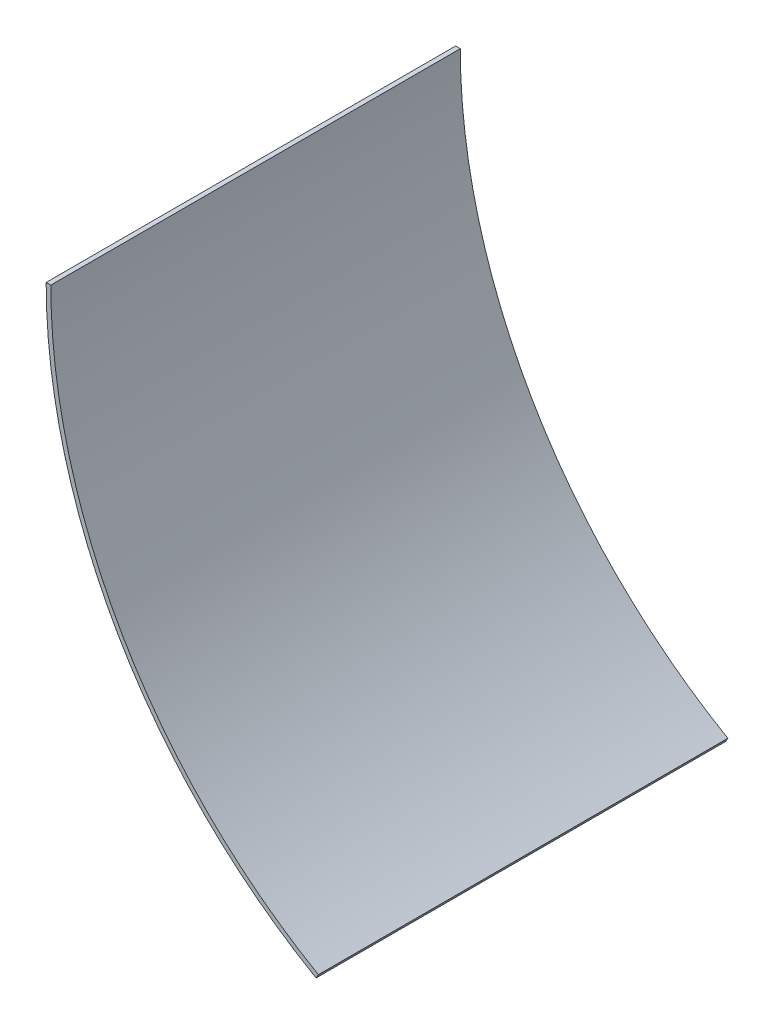
ISO-10303-21;
HEADER;
FILE_DESCRIPTION(('STEP AP214'),'2;1');
FILE_NAME('part.step','',(''),(''),'','','');
FILE_SCHEMA(('AUTOMOTIVE_DESIGN { 1 0 10303 214 1 1 1 1 }'));
ENDSEC;
DATA;
#1=APPLICATION_CONTEXT('core data for automotive mechanical design processes');
#2=APPLICATION_PROTOCOL_DEFINITION('international standard','automotive_design',2000,#1);
#3=PRODUCT_CONTEXT('',#1,'mechanical');
#4=PRODUCT('Part','Part','',(#3));
#5=PRODUCT_RELATED_PRODUCT_CATEGORY('part','',(#4));
#6=PRODUCT_DEFINITION_FORMATION('','',#4);
#7=PRODUCT_DEFINITION_CONTEXT('part definition',#1,'design');
#8=PRODUCT_DEFINITION('design','',#6,#7);
#9=PRODUCT_DEFINITION_SHAPE('','',#8);
#10=(LENGTH_UNIT() NAMED_UNIT(*) SI_UNIT(.MILLI.,.METRE.));
#11=(NAMED_UNIT(*) PLANE_ANGLE_UNIT() SI_UNIT($,.RADIAN.));
#12=(NAMED_UNIT(*) SI_UNIT($,.STERADIAN.) SOLID_ANGLE_UNIT());
#13=UNCERTAINTY_MEASURE_WITH_UNIT(LENGTH_MEASURE(1.E-05),#10,'distance_accuracy_value','');
#14=(GEOMETRIC_REPRESENTATION_CONTEXT(3) GLOBAL_UNCERTAINTY_ASSIGNED_CONTEXT((#13)) GLOBAL_UNIT_ASSIGNED_CONTEXT((#10,
#11,#12)) REPRESENTATION_CONTEXT('',''));
#15=CARTESIAN_POINT('',(0.,0.,0.));
#16=DIRECTION('',(0.,0.,1.));
#17=DIRECTION('',(1.,0.,0.));
#18=AXIS2_PLACEMENT_3D('',#15,#16,#17);
#19=CARTESIAN_POINT('',(0.,0.,139.7));
#20=DIRECTION('',(0.,0.,-1.));
#21=DIRECTION('',(-1.,0.,0.));
#22=AXIS2_PLACEMENT_3D('',#19,#20,#21);
#23=CYLINDRICAL_SURFACE('',#22,182.5625);
#24=CARTESIAN_POINT('',(0.,0.,0.));
#25=DIRECTION('',(0.,0.,-1.));
#26=DIRECTION('',(1.,0.,0.));
#27=AXIS2_PLACEMENT_3D('',#24,#25,#26);
#28=CIRCLE('',#27,182.5625);
#29=CARTESIAN_POINT('',(-91.2812500000007,-158.103762778396,0.));
#30=VERTEX_POINT('',#29);
#31=CARTESIAN_POINT('',(-182.5625,0.,0.));
#32=VERTEX_POINT('',#31);
#33=EDGE_CURVE('E101',#30,#32,#28,.T.);
#34=ORIENTED_EDGE('',*,*,#33,.T.);
#35=DIRECTION('',(0.,0.,-1.));
#36=VECTOR('',#35,1.);
#37=CARTESIAN_POINT('',(-182.5625,0.,139.7));
#38=LINE('',#37,#36);
#39=CARTESIAN_POINT('',(-182.5625,0.,139.7));
#40=VERTEX_POINT('',#39);
#41=EDGE_CURVE('E11',#40,#32,#38,.T.);
#42=ORIENTED_EDGE('',*,*,#41,.F.);
#43=CARTESIAN_POINT('',(0.,0.,139.7));
#44=DIRECTION('',(0.,0.,-1.));
#45=DIRECTION('',(1.,0.,0.));
#46=AXIS2_PLACEMENT_3D('',#43,#44,#45);
#47=CIRCLE('',#46,182.5625);
#48=CARTESIAN_POINT('',(-91.2812500000007,-158.103762778396,139.7));
#49=VERTEX_POINT('',#48);
#50=EDGE_CURVE('E89',#49,#40,#47,.T.);
#51=ORIENTED_EDGE('',*,*,#50,.F.);
#52=DIRECTION('',(0.,0.,-1.));
#53=VECTOR('',#52,1.);
#54=CARTESIAN_POINT('',(-91.2812500000007,-158.103762778396,139.7));
#55=LINE('',#54,#53);
#56=EDGE_CURVE('E97',#49,#30,#55,.T.);
#57=ORIENTED_EDGE('',*,*,#56,.T.);
#58=EDGE_LOOP('',(#34,#42,#51,#57));
#59=FACE_BOUND('',#58,.T.);
#60=ADVANCED_FACE('F38',(#59),#23,.F.);
#61=CARTESIAN_POINT('',(-184.15,0.,139.7));
#62=DIRECTION('',(0.,-1.,0.));
#63=DIRECTION('',(1.,0.,0.));
#64=AXIS2_PLACEMENT_3D('',#61,#62,#63);
#65=PLANE('',#64);
#66=DIRECTION('',(-1.,0.,0.));
#67=VECTOR('',#66,1.);
#68=CARTESIAN_POINT('',(-184.15,0.,0.));
#69=LINE('',#68,#67);
#70=CARTESIAN_POINT('',(-184.15,0.,0.));
#71=VERTEX_POINT('',#70);
#72=EDGE_CURVE('E93',#32,#71,#69,.T.);
#73=ORIENTED_EDGE('',*,*,#72,.T.);
#74=DIRECTION('',(0.,0.,-1.));
#75=VECTOR('',#74,1.);
#76=CARTESIAN_POINT('',(-184.15,0.,139.7));
#77=LINE('',#76,#75);
#78=CARTESIAN_POINT('',(-184.15,0.,139.7));
#79=VERTEX_POINT('',#78);
#80=EDGE_CURVE('E46',#79,#71,#77,.T.);
#81=ORIENTED_EDGE('',*,*,#80,.F.);
#82=DIRECTION('',(-1.,0.,0.));
#83=VECTOR('',#82,1.);
#84=CARTESIAN_POINT('',(-184.15,0.,139.7));
#85=LINE('',#84,#83);
#86=EDGE_CURVE('E84',#40,#79,#85,.T.);
#87=ORIENTED_EDGE('',*,*,#86,.F.);
#88=ORIENTED_EDGE('',*,*,#41,.T.);
#89=EDGE_LOOP('',(#73,#81,#87,#88));
#90=FACE_BOUND('',#89,.T.);
#91=ADVANCED_FACE('F92',(#90),#65,.F.);
#92=CARTESIAN_POINT('',(0.,0.,139.7));
#93=DIRECTION('',(0.,0.,-1.));
#94=DIRECTION('',(-1.,0.,0.));
#95=AXIS2_PLACEMENT_3D('',#92,#93,#94);
#96=CYLINDRICAL_SURFACE('',#95,184.15);
#97=CARTESIAN_POINT('',(0.,0.,0.));
#98=DIRECTION('',(0.,0.,1.));
#99=DIRECTION('',(1.,0.,0.));
#100=AXIS2_PLACEMENT_3D('',#97,#98,#99);
#101=CIRCLE('',#100,184.15);
#102=CARTESIAN_POINT('',(-92.0750000000008,-159.478578106904,0.));
#103=VERTEX_POINT('',#102);
#104=EDGE_CURVE('E71',#71,#103,#101,.T.);
#105=ORIENTED_EDGE('',*,*,#104,.T.);
#106=DIRECTION('',(0.,0.,-1.));
#107=VECTOR('',#106,1.);
#108=CARTESIAN_POINT('',(-92.0750000000008,-159.478578106904,139.7));
#109=LINE('',#108,#107);
#110=CARTESIAN_POINT('',(-92.0750000000008,-159.478578106904,139.7));
#111=VERTEX_POINT('',#110);
#112=EDGE_CURVE('E94',#111,#103,#109,.T.);
#113=ORIENTED_EDGE('',*,*,#112,.F.);
#114=CARTESIAN_POINT('',(0.,0.,139.7));
#115=DIRECTION('',(0.,0.,1.));
#116=DIRECTION('',(1.,0.,0.));
#117=AXIS2_PLACEMENT_3D('',#114,#115,#116);
#118=CIRCLE('',#117,184.15);
#119=EDGE_CURVE('E87',#79,#111,#118,.T.);
#120=ORIENTED_EDGE('',*,*,#119,.F.);
#121=ORIENTED_EDGE('',*,*,#80,.T.);
#122=EDGE_LOOP('',(#105,#113,#120,#121));
#123=FACE_BOUND('',#122,.T.);
#124=ADVANCED_FACE('F95',(#123),#96,.T.);
#125=CARTESIAN_POINT('',(-91.2812500000007,-158.103762778396,139.7));
#126=DIRECTION('',(-0.866025403784424,0.500000000000025,0.));
#127=DIRECTION('',(-0.500000000000025,-0.866025403784424,0.));
#128=AXIS2_PLACEMENT_3D('',#125,#126,#127);
#129=PLANE('',#128);
#130=DIRECTION('',(0.500000000000025,0.866025403784424,0.));
#131=VECTOR('',#130,1.);
#132=CARTESIAN_POINT('',(-91.2812500000007,-158.103762778396,0.));
#133=LINE('',#132,#131);
#134=EDGE_CURVE('E77',#103,#30,#133,.T.);
#135=ORIENTED_EDGE('',*,*,#134,.T.);
#136=ORIENTED_EDGE('',*,*,#56,.F.);
#137=DIRECTION('',(0.500000000000025,0.866025403784424,0.));
#138=VECTOR('',#137,1.);
#139=CARTESIAN_POINT('',(-91.2812500000007,-158.103762778396,139.7));
#140=LINE('',#139,#138);
#141=EDGE_CURVE('E54',#111,#49,#140,.T.);
#142=ORIENTED_EDGE('',*,*,#141,.F.);
#143=ORIENTED_EDGE('',*,*,#112,.T.);
#144=EDGE_LOOP('',(#135,#136,#142,#143));
#145=FACE_BOUND('',#144,.T.);
#146=ADVANCED_FACE('F108',(#145),#129,.F.);
#147=CARTESIAN_POINT('',(0.,0.,139.7));
#148=DIRECTION('',(0.,0.,1.));
#149=DIRECTION('',(1.,0.,0.));
#150=AXIS2_PLACEMENT_3D('',#147,#148,#149);
#151=PLANE('',#150);
#152=ORIENTED_EDGE('',*,*,#50,.T.);
#153=ORIENTED_EDGE('',*,*,#86,.T.);
#154=ORIENTED_EDGE('',*,*,#119,.T.);
#155=ORIENTED_EDGE('',*,*,#141,.T.);
#156=EDGE_LOOP('',(#152,#153,#154,#155));
#157=FACE_BOUND('',#156,.T.);
#158=ADVANCED_FACE('F85',(#157),#151,.T.);
#159=CARTESIAN_POINT('',(0.,0.,0.));
#160=DIRECTION('',(0.,0.,1.));
#161=DIRECTION('',(1.,0.,0.));
#162=AXIS2_PLACEMENT_3D('',#159,#160,#161);
#163=PLANE('',#162);
#164=ORIENTED_EDGE('',*,*,#33,.F.);
#165=ORIENTED_EDGE('',*,*,#134,.F.);
#166=ORIENTED_EDGE('',*,*,#104,.F.);
#167=ORIENTED_EDGE('',*,*,#72,.F.);
#168=EDGE_LOOP('',(#164,#165,#166,#167));
#169=FACE_BOUND('',#168,.T.);
#170=ADVANCED_FACE('F111',(#169),#163,.F.);
#171=CLOSED_SHELL('',(#60,#91,#124,#146,#158,#170));
#172=MANIFOLD_SOLID_BREP('B2',#171);
#173=ADVANCED_BREP_SHAPE_REPRESENTATION('',(#18,#172),#14);
#174=SHAPE_DEFINITION_REPRESENTATION(#9,#173);
ENDSEC;
END-ISO-10303-21;
